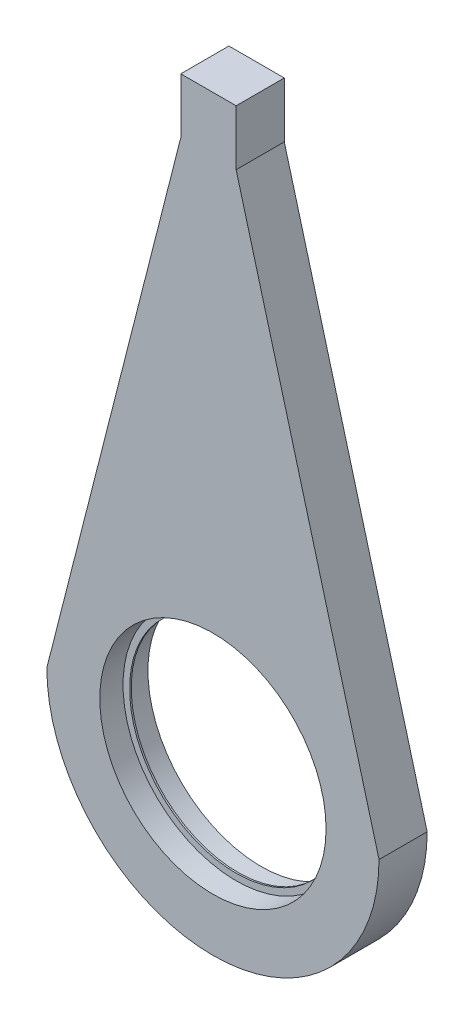
ISO-10303-21;
HEADER;
FILE_DESCRIPTION(('STEP AP214'),'2;1');
FILE_NAME('part.step','',(''),(''),'','','');
FILE_SCHEMA(('AUTOMOTIVE_DESIGN { 1 0 10303 214 1 1 1 1 }'));
ENDSEC;
DATA;
#1=APPLICATION_CONTEXT('core data for automotive mechanical design processes');
#2=APPLICATION_PROTOCOL_DEFINITION('international standard','automotive_design',2000,#1);
#3=PRODUCT_CONTEXT('',#1,'mechanical');
#4=PRODUCT('Part','Part','',(#3));
#5=PRODUCT_RELATED_PRODUCT_CATEGORY('part','',(#4));
#6=PRODUCT_DEFINITION_FORMATION('','',#4);
#7=PRODUCT_DEFINITION_CONTEXT('part definition',#1,'design');
#8=PRODUCT_DEFINITION('design','',#6,#7);
#9=PRODUCT_DEFINITION_SHAPE('','',#8);
#10=(LENGTH_UNIT() NAMED_UNIT(*) SI_UNIT(.MILLI.,.METRE.));
#11=(NAMED_UNIT(*) PLANE_ANGLE_UNIT() SI_UNIT($,.RADIAN.));
#12=(NAMED_UNIT(*) SI_UNIT($,.STERADIAN.) SOLID_ANGLE_UNIT());
#13=UNCERTAINTY_MEASURE_WITH_UNIT(LENGTH_MEASURE(1.E-05),#10,'distance_accuracy_value','');
#14=(GEOMETRIC_REPRESENTATION_CONTEXT(3) GLOBAL_UNCERTAINTY_ASSIGNED_CONTEXT((#13)) GLOBAL_UNIT_ASSIGNED_CONTEXT((#10,
#11,#12)) REPRESENTATION_CONTEXT('',''));
#15=CARTESIAN_POINT('',(0.,0.,0.));
#16=DIRECTION('',(0.,0.,1.));
#17=DIRECTION('',(1.,0.,0.));
#18=AXIS2_PLACEMENT_3D('',#15,#16,#17);
#19=CARTESIAN_POINT('',(-34.5,0.,5.));
#20=DIRECTION('',(0.969075955194496,-0.246762624933101,0.));
#21=DIRECTION('',(0.246762624933101,0.969075955194497,0.));
#22=AXIS2_PLACEMENT_3D('',#19,#20,#21);
#23=PLANE('',#22);
#24=DIRECTION('',(-0.246762624933101,-0.969075955194497,0.));
#25=VECTOR('',#24,1.);
#26=CARTESIAN_POINT('',(-34.5,0.,-5.));
#27=LINE('',#26,#25);
#28=CARTESIAN_POINT('',(-6.68090426304038,109.25,-5.));
#29=VERTEX_POINT('',#28);
#30=CARTESIAN_POINT('',(-34.5,0.,-5.));
#31=VERTEX_POINT('',#30);
#32=EDGE_CURVE('E133',#29,#31,#27,.T.);
#33=ORIENTED_EDGE('',*,*,#32,.T.);
#34=DIRECTION('',(0.,0.,-1.));
#35=VECTOR('',#34,1.);
#36=CARTESIAN_POINT('',(-34.5,0.,5.));
#37=LINE('',#36,#35);
#38=CARTESIAN_POINT('',(-34.5,0.,5.));
#39=VERTEX_POINT('',#38);
#40=EDGE_CURVE('E11',#39,#31,#37,.T.);
#41=ORIENTED_EDGE('',*,*,#40,.F.);
#42=DIRECTION('',(-0.246762624933101,-0.969075955194497,0.));
#43=VECTOR('',#42,1.);
#44=CARTESIAN_POINT('',(-34.5,0.,5.));
#45=LINE('',#44,#43);
#46=CARTESIAN_POINT('',(-6.68090426304038,109.25,5.));
#47=VERTEX_POINT('',#46);
#48=EDGE_CURVE('E150',#47,#39,#45,.T.);
#49=ORIENTED_EDGE('',*,*,#48,.F.);
#50=DIRECTION('',(0.,0.,-1.));
#51=VECTOR('',#50,1.);
#52=CARTESIAN_POINT('',(-6.68090426304038,109.25,5.));
#53=LINE('',#52,#51);
#54=EDGE_CURVE('E129',#47,#29,#53,.T.);
#55=ORIENTED_EDGE('',*,*,#54,.T.);
#56=EDGE_LOOP('',(#33,#41,#49,#55));
#57=FACE_BOUND('',#56,.T.);
#58=ADVANCED_FACE('F43',(#57),#23,.F.);
#59=CARTESIAN_POINT('',(0.,0.,5.));
#60=DIRECTION('',(0.,0.,-1.));
#61=DIRECTION('',(-1.,0.,0.));
#62=AXIS2_PLACEMENT_3D('',#59,#60,#61);
#63=CYLINDRICAL_SURFACE('',#62,34.5);
#64=CARTESIAN_POINT('',(0.,0.,-5.));
#65=DIRECTION('',(0.,0.,1.));
#66=DIRECTION('',(1.,0.,0.));
#67=AXIS2_PLACEMENT_3D('',#64,#65,#66);
#68=CIRCLE('',#67,34.5);
#69=CARTESIAN_POINT('',(34.5,0.,-5.));
#70=VERTEX_POINT('',#69);
#71=EDGE_CURVE('E137',#31,#70,#68,.T.);
#72=ORIENTED_EDGE('',*,*,#71,.T.);
#73=DIRECTION('',(0.,0.,-1.));
#74=VECTOR('',#73,1.);
#75=CARTESIAN_POINT('',(34.5,0.,5.));
#76=LINE('',#75,#74);
#77=CARTESIAN_POINT('',(34.5,0.,5.));
#78=VERTEX_POINT('',#77);
#79=EDGE_CURVE('E53',#78,#70,#76,.T.);
#80=ORIENTED_EDGE('',*,*,#79,.F.);
#81=CARTESIAN_POINT('',(0.,0.,5.));
#82=DIRECTION('',(0.,0.,1.));
#83=DIRECTION('',(1.,0.,0.));
#84=AXIS2_PLACEMENT_3D('',#81,#82,#83);
#85=CIRCLE('',#84,34.5);
#86=EDGE_CURVE('E98',#39,#78,#85,.T.);
#87=ORIENTED_EDGE('',*,*,#86,.F.);
#88=ORIENTED_EDGE('',*,*,#40,.T.);
#89=EDGE_LOOP('',(#72,#80,#87,#88));
#90=FACE_BOUND('',#89,.T.);
#91=ADVANCED_FACE('F180',(#90),#63,.T.);
#92=CARTESIAN_POINT('',(4.81909573695962,109.25,5.));
#93=DIRECTION('',(-0.965020212827188,-0.262175492437736,0.));
#94=DIRECTION('',(0.262175492437736,-0.965020212827188,0.));
#95=AXIS2_PLACEMENT_3D('',#92,#93,#94);
#96=PLANE('',#95);
#97=DIRECTION('',(-0.262175492437736,0.965020212827188,0.));
#98=VECTOR('',#97,1.);
#99=CARTESIAN_POINT('',(4.81909573695962,109.25,-5.));
#100=LINE('',#99,#98);
#101=CARTESIAN_POINT('',(4.81909573695962,109.25,-5.));
#102=VERTEX_POINT('',#101);
#103=EDGE_CURVE('E141',#70,#102,#100,.T.);
#104=ORIENTED_EDGE('',*,*,#103,.T.);
#105=DIRECTION('',(0.,0.,-1.));
#106=VECTOR('',#105,1.);
#107=CARTESIAN_POINT('',(4.81909573695962,109.25,5.));
#108=LINE('',#107,#106);
#109=CARTESIAN_POINT('',(4.81909573695962,109.25,5.));
#110=VERTEX_POINT('',#109);
#111=EDGE_CURVE('E122',#110,#102,#108,.T.);
#112=ORIENTED_EDGE('',*,*,#111,.F.);
#113=DIRECTION('',(-0.262175492437736,0.965020212827188,0.));
#114=VECTOR('',#113,1.);
#115=CARTESIAN_POINT('',(4.81909573695962,109.25,5.));
#116=LINE('',#115,#114);
#117=EDGE_CURVE('E111',#78,#110,#116,.T.);
#118=ORIENTED_EDGE('',*,*,#117,.F.);
#119=ORIENTED_EDGE('',*,*,#79,.T.);
#120=EDGE_LOOP('',(#104,#112,#118,#119));
#121=FACE_BOUND('',#120,.T.);
#122=ADVANCED_FACE('F161',(#121),#96,.F.);
#123=CARTESIAN_POINT('',(4.81909573695962,120.75,5.));
#124=DIRECTION('',(-1.,0.,0.));
#125=DIRECTION('',(0.,-1.,0.));
#126=AXIS2_PLACEMENT_3D('',#123,#124,#125);
#127=PLANE('',#126);
#128=DIRECTION('',(0.,1.,0.));
#129=VECTOR('',#128,1.);
#130=CARTESIAN_POINT('',(4.81909573695962,120.75,-5.));
#131=LINE('',#130,#129);
#132=CARTESIAN_POINT('',(4.81909573695962,120.75,-5.));
#133=VERTEX_POINT('',#132);
#134=EDGE_CURVE('E120',#102,#133,#131,.T.);
#135=ORIENTED_EDGE('',*,*,#134,.T.);
#136=DIRECTION('',(0.,0.,-1.));
#137=VECTOR('',#136,1.);
#138=CARTESIAN_POINT('',(4.81909573695962,120.75,5.));
#139=LINE('',#138,#137);
#140=CARTESIAN_POINT('',(4.81909573695962,120.75,5.));
#141=VERTEX_POINT('',#140);
#142=EDGE_CURVE('E117',#141,#133,#139,.T.);
#143=ORIENTED_EDGE('',*,*,#142,.F.);
#144=DIRECTION('',(0.,1.,0.));
#145=VECTOR('',#144,1.);
#146=CARTESIAN_POINT('',(4.81909573695962,120.75,5.));
#147=LINE('',#146,#145);
#148=EDGE_CURVE('E105',#110,#141,#147,.T.);
#149=ORIENTED_EDGE('',*,*,#148,.F.);
#150=ORIENTED_EDGE('',*,*,#111,.T.);
#151=EDGE_LOOP('',(#135,#143,#149,#150));
#152=FACE_BOUND('',#151,.T.);
#153=ADVANCED_FACE('F118',(#152),#127,.F.);
#154=CARTESIAN_POINT('',(4.81909573695962,120.75,5.));
#155=DIRECTION('',(0.,-1.,0.));
#156=DIRECTION('',(0.,0.,-1.));
#157=AXIS2_PLACEMENT_3D('',#154,#155,#156);
#158=PLANE('',#157);
#159=DIRECTION('',(-1.,0.,0.));
#160=VECTOR('',#159,1.);
#161=CARTESIAN_POINT('',(4.81909573695962,120.75,-5.));
#162=LINE('',#161,#160);
#163=CARTESIAN_POINT('',(-6.68090426304038,120.75,-5.));
#164=VERTEX_POINT('',#163);
#165=EDGE_CURVE('E84',#133,#164,#162,.T.);
#166=ORIENTED_EDGE('',*,*,#165,.T.);
#167=DIRECTION('',(0.,0.,-1.));
#168=VECTOR('',#167,1.);
#169=CARTESIAN_POINT('',(-6.68090426304038,120.75,5.));
#170=LINE('',#169,#168);
#171=CARTESIAN_POINT('',(-6.68090426304038,120.75,5.));
#172=VERTEX_POINT('',#171);
#173=EDGE_CURVE('E123',#172,#164,#170,.T.);
#174=ORIENTED_EDGE('',*,*,#173,.F.);
#175=DIRECTION('',(-1.,0.,0.));
#176=VECTOR('',#175,1.);
#177=CARTESIAN_POINT('',(4.81909573695962,120.75,5.));
#178=LINE('',#177,#176);
#179=EDGE_CURVE('E109',#141,#172,#178,.T.);
#180=ORIENTED_EDGE('',*,*,#179,.F.);
#181=ORIENTED_EDGE('',*,*,#142,.T.);
#182=EDGE_LOOP('',(#166,#174,#180,#181));
#183=FACE_BOUND('',#182,.T.);
#184=ADVANCED_FACE('F125',(#183),#158,.F.);
#185=CARTESIAN_POINT('',(-6.68090426304038,120.75,5.));
#186=DIRECTION('',(1.,0.,0.));
#187=DIRECTION('',(0.,0.,-1.));
#188=AXIS2_PLACEMENT_3D('',#185,#186,#187);
#189=PLANE('',#188);
#190=DIRECTION('',(0.,-1.,0.));
#191=VECTOR('',#190,1.);
#192=CARTESIAN_POINT('',(-6.68090426304038,120.75,-5.));
#193=LINE('',#192,#191);
#194=EDGE_CURVE('E90',#164,#29,#193,.T.);
#195=ORIENTED_EDGE('',*,*,#194,.T.);
#196=ORIENTED_EDGE('',*,*,#54,.F.);
#197=DIRECTION('',(0.,-1.,0.));
#198=VECTOR('',#197,1.);
#199=CARTESIAN_POINT('',(-6.68090426304038,120.75,5.));
#200=LINE('',#199,#198);
#201=EDGE_CURVE('E61',#172,#47,#200,.T.);
#202=ORIENTED_EDGE('',*,*,#201,.F.);
#203=ORIENTED_EDGE('',*,*,#173,.T.);
#204=EDGE_LOOP('',(#195,#196,#202,#203));
#205=FACE_BOUND('',#204,.T.);
#206=ADVANCED_FACE('F168',(#205),#189,.F.);
#207=CARTESIAN_POINT('',(0.,0.,5.));
#208=DIRECTION('',(0.,0.,1.));
#209=DIRECTION('',(1.,0.,0.));
#210=AXIS2_PLACEMENT_3D('',#207,#208,#209);
#211=PLANE('',#210);
#212=CARTESIAN_POINT('',(0.,0.,5.));
#213=DIRECTION('',(0.,0.,1.));
#214=DIRECTION('',(1.,0.,0.));
#215=AXIS2_PLACEMENT_3D('',#212,#213,#214);
#216=CIRCLE('',#215,23.5);
#217=CARTESIAN_POINT('',(23.5,0.,5.));
#218=VERTEX_POINT('',#217);
#219=EDGE_CURVE('E327',#218,#218,#216,.T.);
#220=ORIENTED_EDGE('',*,*,#219,.F.);
#221=EDGE_LOOP('',(#220));
#222=FACE_BOUND('',#221,.T.);
#223=ORIENTED_EDGE('',*,*,#48,.T.);
#224=ORIENTED_EDGE('',*,*,#86,.T.);
#225=ORIENTED_EDGE('',*,*,#117,.T.);
#226=ORIENTED_EDGE('',*,*,#148,.T.);
#227=ORIENTED_EDGE('',*,*,#179,.T.);
#228=ORIENTED_EDGE('',*,*,#201,.T.);
#229=EDGE_LOOP('',(#223,#224,#225,#226,#227,#228));
#230=FACE_BOUND('',#229,.T.);
#231=ADVANCED_FACE('F107',(#222,#230),#211,.T.);
#232=CARTESIAN_POINT('',(0.,0.,-5.));
#233=DIRECTION('',(0.,0.,1.));
#234=DIRECTION('',(1.,0.,0.));
#235=AXIS2_PLACEMENT_3D('',#232,#233,#234);
#236=PLANE('',#235);
#237=CARTESIAN_POINT('',(0.,0.,-5.));
#238=DIRECTION('',(0.,0.,1.));
#239=DIRECTION('',(1.,0.,0.));
#240=AXIS2_PLACEMENT_3D('',#237,#238,#239);
#241=CIRCLE('',#240,23.5);
#242=CARTESIAN_POINT('',(23.5,0.,-5.));
#243=VERTEX_POINT('',#242);
#244=EDGE_CURVE('E318',#243,#243,#241,.T.);
#245=ORIENTED_EDGE('',*,*,#244,.T.);
#246=EDGE_LOOP('',(#245));
#247=FACE_BOUND('',#246,.T.);
#248=ORIENTED_EDGE('',*,*,#32,.F.);
#249=ORIENTED_EDGE('',*,*,#194,.F.);
#250=ORIENTED_EDGE('',*,*,#165,.F.);
#251=ORIENTED_EDGE('',*,*,#134,.F.);
#252=ORIENTED_EDGE('',*,*,#103,.F.);
#253=ORIENTED_EDGE('',*,*,#71,.F.);
#254=EDGE_LOOP('',(#248,#249,#250,#251,#252,#253));
#255=FACE_BOUND('',#254,.T.);
#256=ADVANCED_FACE('F164',(#247,#255),#236,.F.);
#257=CARTESIAN_POINT('',(0.,0.,0.17));
#258=DIRECTION('',(0.,0.,1.));
#259=DIRECTION('',(1.,0.,0.));
#260=AXIS2_PLACEMENT_3D('',#257,#258,#259);
#261=CYLINDRICAL_SURFACE('',#260,23.5);
#262=CARTESIAN_POINT('',(0.,0.,0.17));
#263=DIRECTION('',(0.,0.,1.));
#264=DIRECTION('',(1.,0.,0.));
#265=AXIS2_PLACEMENT_3D('',#262,#263,#264);
#266=CIRCLE('',#265,23.5);
#267=CARTESIAN_POINT('',(23.5,0.,0.17));
#268=VERTEX_POINT('',#267);
#269=EDGE_CURVE('E138',#268,#268,#266,.T.);
#270=ORIENTED_EDGE('',*,*,#269,.F.);
#271=EDGE_LOOP('',(#270));
#272=FACE_BOUND('',#271,.T.);
#273=ORIENTED_EDGE('',*,*,#219,.T.);
#274=EDGE_LOOP('',(#273));
#275=FACE_BOUND('',#274,.T.);
#276=ADVANCED_FACE('F218',(#272,#275),#261,.F.);
#277=CARTESIAN_POINT('',(0.,0.,0.17));
#278=DIRECTION('',(0.,0.,1.));
#279=DIRECTION('',(1.,0.,0.));
#280=AXIS2_PLACEMENT_3D('',#277,#278,#279);
#281=PLANE('',#280);
#282=CARTESIAN_POINT('',(0.,0.,0.17));
#283=DIRECTION('',(0.,0.,1.));
#284=DIRECTION('',(1.,0.,0.));
#285=AXIS2_PLACEMENT_3D('',#282,#283,#284);
#286=CIRCLE('',#285,22.1375);
#287=CARTESIAN_POINT('',(22.1375,0.,0.17));
#288=VERTEX_POINT('',#287);
#289=EDGE_CURVE('E313',#288,#288,#286,.T.);
#290=ORIENTED_EDGE('',*,*,#289,.F.);
#291=EDGE_LOOP('',(#290));
#292=FACE_BOUND('',#291,.T.);
#293=ORIENTED_EDGE('',*,*,#269,.T.);
#294=EDGE_LOOP('',(#293));
#295=FACE_BOUND('',#294,.T.);
#296=ADVANCED_FACE('F223',(#292,#295),#281,.T.);
#297=CARTESIAN_POINT('',(0.,0.,-0.17));
#298=DIRECTION('',(0.,0.,-1.));
#299=DIRECTION('',(-1.,0.,0.));
#300=AXIS2_PLACEMENT_3D('',#297,#298,#299);
#301=CYLINDRICAL_SURFACE('',#300,23.5);
#302=CARTESIAN_POINT('',(0.,0.,-0.17));
#303=DIRECTION('',(0.,0.,1.));
#304=DIRECTION('',(1.,0.,0.));
#305=AXIS2_PLACEMENT_3D('',#302,#303,#304);
#306=CIRCLE('',#305,23.5);
#307=CARTESIAN_POINT('',(23.5,0.,-0.17));
#308=VERTEX_POINT('',#307);
#309=EDGE_CURVE('E322',#308,#308,#306,.T.);
#310=ORIENTED_EDGE('',*,*,#309,.T.);
#311=EDGE_LOOP('',(#310));
#312=FACE_BOUND('',#311,.T.);
#313=ORIENTED_EDGE('',*,*,#244,.F.);
#314=EDGE_LOOP('',(#313));
#315=FACE_BOUND('',#314,.T.);
#316=ADVANCED_FACE('F239',(#312,#315),#301,.F.);
#317=CARTESIAN_POINT('',(0.,0.,-0.17));
#318=DIRECTION('',(0.,0.,1.));
#319=DIRECTION('',(1.,0.,0.));
#320=AXIS2_PLACEMENT_3D('',#317,#318,#319);
#321=PLANE('',#320);
#322=CARTESIAN_POINT('',(0.,0.,-0.17));
#323=DIRECTION('',(0.,0.,1.));
#324=DIRECTION('',(1.,0.,0.));
#325=AXIS2_PLACEMENT_3D('',#322,#323,#324);
#326=CIRCLE('',#325,22.1375);
#327=CARTESIAN_POINT('',(22.1375,0.,-0.17));
#328=VERTEX_POINT('',#327);
#329=EDGE_CURVE('E46',#328,#328,#326,.T.);
#330=ORIENTED_EDGE('',*,*,#329,.T.);
#331=EDGE_LOOP('',(#330));
#332=FACE_BOUND('',#331,.T.);
#333=ORIENTED_EDGE('',*,*,#309,.F.);
#334=EDGE_LOOP('',(#333));
#335=FACE_BOUND('',#334,.T.);
#336=ADVANCED_FACE('F244',(#332,#335),#321,.F.);
#337=CARTESIAN_POINT('',(0.,0.,-5.));
#338=DIRECTION('',(0.,0.,1.));
#339=DIRECTION('',(1.,0.,0.));
#340=AXIS2_PLACEMENT_3D('',#337,#338,#339);
#341=CYLINDRICAL_SURFACE('',#340,22.1375);
#342=ORIENTED_EDGE('',*,*,#289,.T.);
#343=EDGE_LOOP('',(#342));
#344=FACE_BOUND('',#343,.T.);
#345=ORIENTED_EDGE('',*,*,#329,.F.);
#346=EDGE_LOOP('',(#345));
#347=FACE_BOUND('',#346,.T.);
#348=ADVANCED_FACE('F263',(#344,#347),#341,.F.);
#349=CLOSED_SHELL('',(#58,#91,#122,#153,#184,#206,#231,#256,#276,#296,#316,#336,#348));
#350=MANIFOLD_SOLID_BREP('B2',#349);
#351=ADVANCED_BREP_SHAPE_REPRESENTATION('',(#18,#350),#14);
#352=SHAPE_DEFINITION_REPRESENTATION(#9,#351);
ENDSEC;
END-ISO-10303-21;
